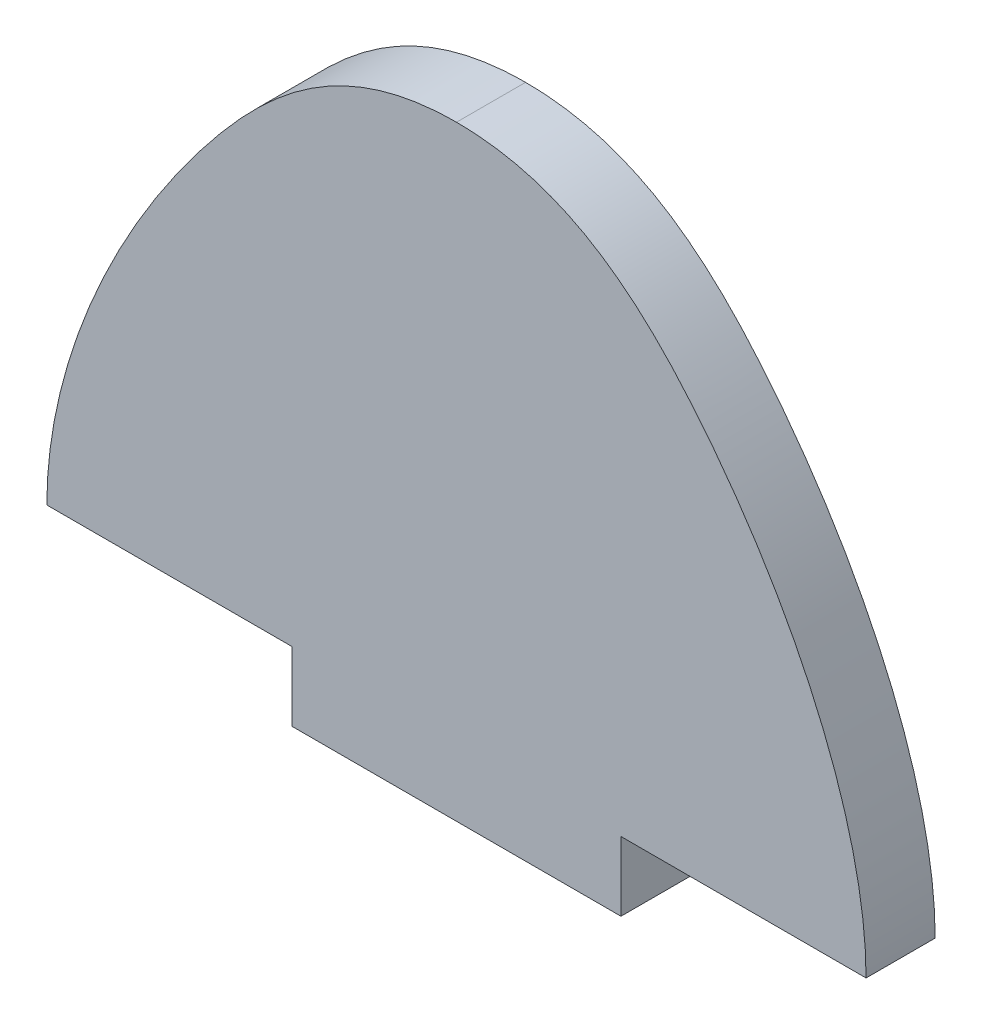
ISO-10303-21;
HEADER;
FILE_DESCRIPTION(('STEP AP214'),'2;1');
FILE_NAME('part.step','',(''),(''),'','','');
FILE_SCHEMA(('AUTOMOTIVE_DESIGN { 1 0 10303 214 1 1 1 1 }'));
ENDSEC;
DATA;
#1=APPLICATION_CONTEXT('core data for automotive mechanical design processes');
#2=APPLICATION_PROTOCOL_DEFINITION('international standard','automotive_design',2000,#1);
#3=PRODUCT_CONTEXT('',#1,'mechanical');
#4=PRODUCT('Part','Part','',(#3));
#5=PRODUCT_RELATED_PRODUCT_CATEGORY('part','',(#4));
#6=PRODUCT_DEFINITION_FORMATION('','',#4);
#7=PRODUCT_DEFINITION_CONTEXT('part definition',#1,'design');
#8=PRODUCT_DEFINITION('design','',#6,#7);
#9=PRODUCT_DEFINITION_SHAPE('','',#8);
#10=(LENGTH_UNIT() NAMED_UNIT(*) SI_UNIT(.MILLI.,.METRE.));
#11=(NAMED_UNIT(*) PLANE_ANGLE_UNIT() SI_UNIT($,.RADIAN.));
#12=(NAMED_UNIT(*) SI_UNIT($,.STERADIAN.) SOLID_ANGLE_UNIT());
#13=UNCERTAINTY_MEASURE_WITH_UNIT(LENGTH_MEASURE(1.E-05),#10,'distance_accuracy_value','');
#14=(GEOMETRIC_REPRESENTATION_CONTEXT(3) GLOBAL_UNCERTAINTY_ASSIGNED_CONTEXT((#13)) GLOBAL_UNIT_ASSIGNED_CONTEXT((#10,
#11,#12)) REPRESENTATION_CONTEXT('',''));
#15=CARTESIAN_POINT('',(0.,0.,0.));
#16=DIRECTION('',(0.,0.,1.));
#17=DIRECTION('',(1.,0.,0.));
#18=AXIS2_PLACEMENT_3D('',#15,#16,#17);
#19=CARTESIAN_POINT('',(38.989,0.,5.334));
#20=DIRECTION('',(1.,0.,0.));
#21=DIRECTION('',(0.,0.,-1.));
#22=AXIS2_PLACEMENT_3D('',#19,#20,#21);
#23=PLANE('',#22);
#24=DIRECTION('',(0.,-1.,0.));
#25=VECTOR('',#24,1.);
#26=CARTESIAN_POINT('',(38.989,0.,0.));
#27=LINE('',#26,#25);
#28=CARTESIAN_POINT('',(38.989,0.,0.));
#29=VERTEX_POINT('',#28);
#30=CARTESIAN_POINT('',(38.989,-5.334,0.));
#31=VERTEX_POINT('',#30);
#32=EDGE_CURVE('E123',#29,#31,#27,.T.);
#33=ORIENTED_EDGE('',*,*,#32,.F.);
#34=DIRECTION('',(0.,0.,-1.));
#35=VECTOR('',#34,1.);
#36=CARTESIAN_POINT('',(38.989,0.,5.334));
#37=LINE('',#36,#35);
#38=CARTESIAN_POINT('',(38.989,0.,5.334));
#39=VERTEX_POINT('',#38);
#40=EDGE_CURVE('E11',#39,#29,#37,.T.);
#41=ORIENTED_EDGE('',*,*,#40,.F.);
#42=DIRECTION('',(0.,-1.,0.));
#43=VECTOR('',#42,1.);
#44=CARTESIAN_POINT('',(38.989,0.,5.334));
#45=LINE('',#44,#43);
#46=CARTESIAN_POINT('',(38.989,-5.334,5.334));
#47=VERTEX_POINT('',#46);
#48=EDGE_CURVE('E148',#39,#47,#45,.T.);
#49=ORIENTED_EDGE('',*,*,#48,.T.);
#50=DIRECTION('',(0.,0.,-1.));
#51=VECTOR('',#50,1.);
#52=CARTESIAN_POINT('',(38.989,-5.334,5.334));
#53=LINE('',#52,#51);
#54=EDGE_CURVE('E85',#47,#31,#53,.T.);
#55=ORIENTED_EDGE('',*,*,#54,.T.);
#56=EDGE_LOOP('',(#33,#41,#49,#55));
#57=FACE_BOUND('',#56,.T.);
#58=ADVANCED_FACE('F37',(#57),#23,.T.);
#59=CARTESIAN_POINT('',(0.,0.,5.334));
#60=DIRECTION('',(0.,1.,0.));
#61=DIRECTION('',(0.,0.,1.));
#62=AXIS2_PLACEMENT_3D('',#59,#60,#61);
#63=PLANE('',#62);
#64=DIRECTION('',(1.,0.,0.));
#65=VECTOR('',#64,1.);
#66=CARTESIAN_POINT('',(0.,0.,0.));
#67=LINE('',#66,#65);
#68=CARTESIAN_POINT('',(57.912,0.,0.));
#69=VERTEX_POINT('',#68);
#70=EDGE_CURVE('E126',#29,#69,#67,.T.);
#71=ORIENTED_EDGE('',*,*,#70,.T.);
#72=DIRECTION('',(0.,0.,-1.));
#73=VECTOR('',#72,1.);
#74=CARTESIAN_POINT('',(57.912,0.,5.334));
#75=LINE('',#74,#73);
#76=CARTESIAN_POINT('',(57.912,0.,5.334));
#77=VERTEX_POINT('',#76);
#78=EDGE_CURVE('E45',#77,#69,#75,.T.);
#79=ORIENTED_EDGE('',*,*,#78,.F.);
#80=DIRECTION('',(1.,0.,0.));
#81=VECTOR('',#80,1.);
#82=CARTESIAN_POINT('',(0.,0.,5.334));
#83=LINE('',#82,#81);
#84=EDGE_CURVE('E168',#39,#77,#83,.T.);
#85=ORIENTED_EDGE('',*,*,#84,.F.);
#86=ORIENTED_EDGE('',*,*,#40,.T.);
#87=EDGE_LOOP('',(#71,#79,#85,#86));
#88=FACE_BOUND('',#87,.T.);
#89=ADVANCED_FACE('F186',(#88),#63,.F.);
#90=CARTESIAN_POINT('',(57.912,0.,5.334));
#91=CARTESIAN_POINT('',(57.912,10.018830830654,5.334));
#92=CARTESIAN_POINT('',(48.9465453048912,29.2855997606862,5.334));
#93=CARTESIAN_POINT('',(34.8883944615004,41.402,5.334));
#94=CARTESIAN_POINT('',(26.289,41.402,5.334));
#95=B_SPLINE_CURVE_WITH_KNOTS('',3,(#90,#91,#92,#93,#94),.UNSPECIFIED.,.F.,.F.,(4,1,4),(0.,
0.604390218483786,1.),.UNSPECIFIED.);
#96=DIRECTION('',(0.,0.,-1.));
#97=VECTOR('',#96,1.);
#98=SURFACE_OF_LINEAR_EXTRUSION('',#95,#97);
#99=CARTESIAN_POINT('',(57.912,0.,0.));
#100=CARTESIAN_POINT('',(57.912,10.018830830654,0.));
#101=CARTESIAN_POINT('',(48.9465453048912,29.2855997606862,0.));
#102=CARTESIAN_POINT('',(34.8883944615004,41.402,0.));
#103=CARTESIAN_POINT('',(26.289,41.402,0.));
#104=B_SPLINE_CURVE_WITH_KNOTS('',3,(#99,#100,#101,#102,#103),.UNSPECIFIED.,.F.,.F.,(4,1,4),(0.,
0.604390218483786,1.),.UNSPECIFIED.);
#105=CARTESIAN_POINT('',(26.289,41.402,0.));
#106=VERTEX_POINT('',#105);
#107=EDGE_CURVE('E128',#69,#106,#104,.T.);
#108=ORIENTED_EDGE('',*,*,#107,.T.);
#109=DIRECTION('',(0.,0.,-1.));
#110=VECTOR('',#109,1.);
#111=CARTESIAN_POINT('',(26.289,41.402,5.334));
#112=LINE('',#111,#110);
#113=CARTESIAN_POINT('',(26.289,41.402,5.334));
#114=VERTEX_POINT('',#113);
#115=EDGE_CURVE('E152',#114,#106,#112,.T.);
#116=ORIENTED_EDGE('',*,*,#115,.F.);
#117=EDGE_CURVE('E160',#77,#114,#95,.T.);
#118=ORIENTED_EDGE('',*,*,#117,.F.);
#119=ORIENTED_EDGE('',*,*,#78,.T.);
#120=EDGE_LOOP('',(#108,#116,#118,#119));
#121=FACE_BOUND('',#120,.T.);
#122=ADVANCED_FACE('F158',(#121),#98,.F.);
#123=CARTESIAN_POINT('',(-5.334,0.,5.334));
#124=CARTESIAN_POINT('',(-5.334,10.018830830654,5.334));
#125=CARTESIAN_POINT('',(3.63145469510874,29.2855997606862,5.334));
#126=CARTESIAN_POINT('',(17.6896055384996,41.402,5.334));
#127=CARTESIAN_POINT('',(26.289,41.402,5.334));
#128=B_SPLINE_CURVE_WITH_KNOTS('',3,(#123,#124,#125,#126,#127),.UNSPECIFIED.,.F.,.F.,(4,1,4),
(0.,0.604390218483786,1.),.UNSPECIFIED.);
#129=DIRECTION('',(0.,0.,-1.));
#130=VECTOR('',#129,1.);
#131=SURFACE_OF_LINEAR_EXTRUSION('',#128,#130);
#132=CARTESIAN_POINT('',(-5.334,0.,0.));
#133=CARTESIAN_POINT('',(-5.334,10.018830830654,0.));
#134=CARTESIAN_POINT('',(3.63145469510874,29.2855997606862,0.));
#135=CARTESIAN_POINT('',(17.6896055384996,41.402,0.));
#136=CARTESIAN_POINT('',(26.289,41.402,0.));
#137=B_SPLINE_CURVE_WITH_KNOTS('',3,(#132,#133,#134,#135,#136),.UNSPECIFIED.,.F.,.F.,(4,1,4),
(0.,0.604390218483786,1.),.UNSPECIFIED.);
#138=CARTESIAN_POINT('',(-5.334,0.,0.));
#139=VERTEX_POINT('',#138);
#140=EDGE_CURVE('E133',#139,#106,#137,.T.);
#141=ORIENTED_EDGE('',*,*,#140,.F.);
#142=DIRECTION('',(0.,0.,-1.));
#143=VECTOR('',#142,1.);
#144=CARTESIAN_POINT('',(-5.334,0.,5.334));
#145=LINE('',#144,#143);
#146=CARTESIAN_POINT('',(-5.334,0.,5.334));
#147=VERTEX_POINT('',#146);
#148=EDGE_CURVE('E115',#147,#139,#145,.T.);
#149=ORIENTED_EDGE('',*,*,#148,.F.);
#150=EDGE_CURVE('E108',#147,#114,#128,.T.);
#151=ORIENTED_EDGE('',*,*,#150,.T.);
#152=ORIENTED_EDGE('',*,*,#115,.T.);
#153=EDGE_LOOP('',(#141,#149,#151,#152));
#154=FACE_BOUND('',#153,.T.);
#155=ADVANCED_FACE('F167',(#154),#131,.T.);
#156=CARTESIAN_POINT('',(0.,0.,5.334));
#157=DIRECTION('',(0.,1.,0.));
#158=DIRECTION('',(0.,0.,1.));
#159=AXIS2_PLACEMENT_3D('',#156,#157,#158);
#160=PLANE('',#159);
#161=DIRECTION('',(1.,0.,0.));
#162=VECTOR('',#161,1.);
#163=CARTESIAN_POINT('',(0.,0.,0.));
#164=LINE('',#163,#162);
#165=CARTESIAN_POINT('',(13.589,0.,0.));
#166=VERTEX_POINT('',#165);
#167=EDGE_CURVE('E114',#139,#166,#164,.T.);
#168=ORIENTED_EDGE('',*,*,#167,.T.);
#169=DIRECTION('',(0.,0.,-1.));
#170=VECTOR('',#169,1.);
#171=CARTESIAN_POINT('',(13.589,0.,5.334));
#172=LINE('',#171,#170);
#173=CARTESIAN_POINT('',(13.589,0.,5.334));
#174=VERTEX_POINT('',#173);
#175=EDGE_CURVE('E111',#174,#166,#172,.T.);
#176=ORIENTED_EDGE('',*,*,#175,.F.);
#177=DIRECTION('',(1.,0.,0.));
#178=VECTOR('',#177,1.);
#179=CARTESIAN_POINT('',(0.,0.,5.334));
#180=LINE('',#179,#178);
#181=EDGE_CURVE('E102',#147,#174,#180,.T.);
#182=ORIENTED_EDGE('',*,*,#181,.F.);
#183=ORIENTED_EDGE('',*,*,#148,.T.);
#184=EDGE_LOOP('',(#168,#176,#182,#183));
#185=FACE_BOUND('',#184,.T.);
#186=ADVANCED_FACE('F112',(#185),#160,.F.);
#187=CARTESIAN_POINT('',(13.589,0.,5.334));
#188=DIRECTION('',(1.,0.,0.));
#189=DIRECTION('',(0.,0.,-1.));
#190=AXIS2_PLACEMENT_3D('',#187,#188,#189);
#191=PLANE('',#190);
#192=DIRECTION('',(0.,-1.,0.));
#193=VECTOR('',#192,1.);
#194=CARTESIAN_POINT('',(13.589,0.,0.));
#195=LINE('',#194,#193);
#196=CARTESIAN_POINT('',(13.589,-5.334,0.));
#197=VERTEX_POINT('',#196);
#198=EDGE_CURVE('E78',#166,#197,#195,.T.);
#199=ORIENTED_EDGE('',*,*,#198,.T.);
#200=DIRECTION('',(0.,0.,-1.));
#201=VECTOR('',#200,1.);
#202=CARTESIAN_POINT('',(13.589,-5.334,5.334));
#203=LINE('',#202,#201);
#204=CARTESIAN_POINT('',(13.589,-5.334,5.334));
#205=VERTEX_POINT('',#204);
#206=EDGE_CURVE('E116',#205,#197,#203,.T.);
#207=ORIENTED_EDGE('',*,*,#206,.F.);
#208=DIRECTION('',(0.,-1.,0.));
#209=VECTOR('',#208,1.);
#210=CARTESIAN_POINT('',(13.589,0.,5.334));
#211=LINE('',#210,#209);
#212=EDGE_CURVE('E106',#174,#205,#211,.T.);
#213=ORIENTED_EDGE('',*,*,#212,.F.);
#214=ORIENTED_EDGE('',*,*,#175,.T.);
#215=EDGE_LOOP('',(#199,#207,#213,#214));
#216=FACE_BOUND('',#215,.T.);
#217=ADVANCED_FACE('F118',(#216),#191,.F.);
#218=CARTESIAN_POINT('',(0.,-5.334,5.334));
#219=DIRECTION('',(0.,1.,0.));
#220=DIRECTION('',(0.,0.,1.));
#221=AXIS2_PLACEMENT_3D('',#218,#219,#220);
#222=PLANE('',#221);
#223=DIRECTION('',(1.,0.,0.));
#224=VECTOR('',#223,1.);
#225=CARTESIAN_POINT('',(0.,-5.334,0.));
#226=LINE('',#225,#224);
#227=EDGE_CURVE('E146',#197,#31,#226,.T.);
#228=ORIENTED_EDGE('',*,*,#227,.T.);
#229=ORIENTED_EDGE('',*,*,#54,.F.);
#230=DIRECTION('',(1.,0.,0.));
#231=VECTOR('',#230,1.);
#232=CARTESIAN_POINT('',(0.,-5.334,5.334));
#233=LINE('',#232,#231);
#234=EDGE_CURVE('E53',#205,#47,#233,.T.);
#235=ORIENTED_EDGE('',*,*,#234,.F.);
#236=ORIENTED_EDGE('',*,*,#206,.T.);
#237=EDGE_LOOP('',(#228,#229,#235,#236));
#238=FACE_BOUND('',#237,.T.);
#239=ADVANCED_FACE('F194',(#238),#222,.F.);
#240=CARTESIAN_POINT('',(0.,0.,5.334));
#241=DIRECTION('',(0.,0.,1.));
#242=DIRECTION('',(1.,0.,0.));
#243=AXIS2_PLACEMENT_3D('',#240,#241,#242);
#244=PLANE('',#243);
#245=ORIENTED_EDGE('',*,*,#48,.F.);
#246=ORIENTED_EDGE('',*,*,#84,.T.);
#247=ORIENTED_EDGE('',*,*,#117,.T.);
#248=ORIENTED_EDGE('',*,*,#150,.F.);
#249=ORIENTED_EDGE('',*,*,#181,.T.);
#250=ORIENTED_EDGE('',*,*,#212,.T.);
#251=ORIENTED_EDGE('',*,*,#234,.T.);
#252=EDGE_LOOP('',(#245,#246,#247,#248,#249,#250,#251));
#253=FACE_BOUND('',#252,.T.);
#254=ADVANCED_FACE('F104',(#253),#244,.T.);
#255=CARTESIAN_POINT('',(0.,0.,0.));
#256=DIRECTION('',(0.,0.,1.));
#257=DIRECTION('',(1.,0.,0.));
#258=AXIS2_PLACEMENT_3D('',#255,#256,#257);
#259=PLANE('',#258);
#260=ORIENTED_EDGE('',*,*,#32,.T.);
#261=ORIENTED_EDGE('',*,*,#227,.F.);
#262=ORIENTED_EDGE('',*,*,#198,.F.);
#263=ORIENTED_EDGE('',*,*,#167,.F.);
#264=ORIENTED_EDGE('',*,*,#140,.T.);
#265=ORIENTED_EDGE('',*,*,#107,.F.);
#266=ORIENTED_EDGE('',*,*,#70,.F.);
#267=EDGE_LOOP('',(#260,#261,#262,#263,#264,#265,#266));
#268=FACE_BOUND('',#267,.T.);
#269=ADVANCED_FACE('F164',(#268),#259,.F.);
#270=CLOSED_SHELL('',(#58,#89,#122,#155,#186,#217,#239,#254,#269));
#271=MANIFOLD_SOLID_BREP('B2',#270);
#272=ADVANCED_BREP_SHAPE_REPRESENTATION('',(#18,#271),#14);
#273=SHAPE_DEFINITION_REPRESENTATION(#9,#272);
ENDSEC;
END-ISO-10303-21;
